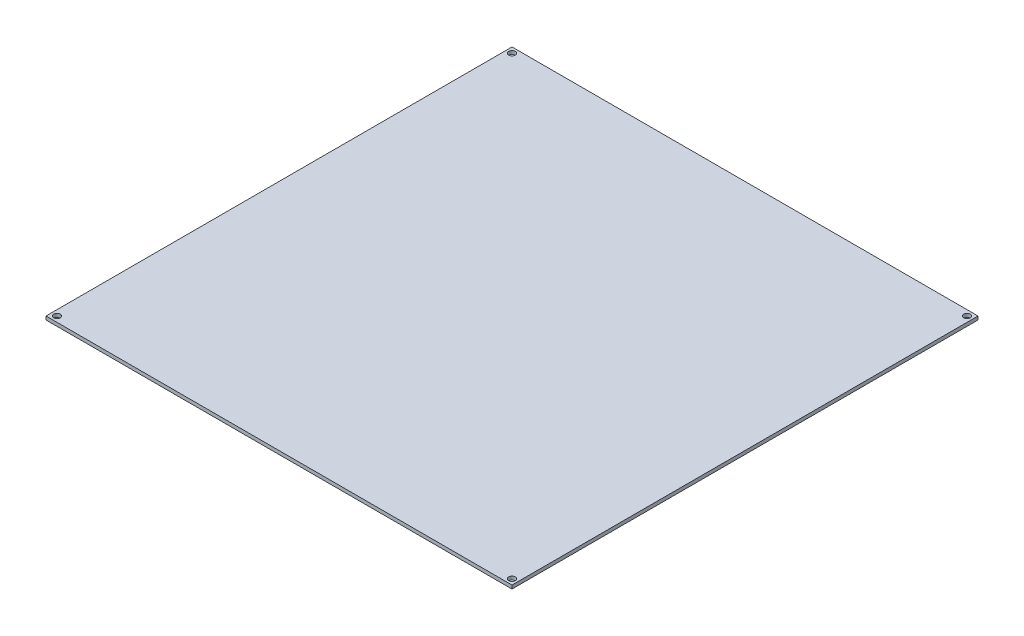
ISO-10303-21;
HEADER;
FILE_DESCRIPTION(('STEP AP214'),'2;1');
FILE_NAME('part.step','',(''),(''),'','','');
FILE_SCHEMA(('AUTOMOTIVE_DESIGN { 1 0 10303 214 1 1 1 1 }'));
ENDSEC;
DATA;
#1=APPLICATION_CONTEXT('core data for automotive mechanical design processes');
#2=APPLICATION_PROTOCOL_DEFINITION('international standard','automotive_design',2000,#1);
#3=PRODUCT_CONTEXT('',#1,'mechanical');
#4=PRODUCT('Part','Part','',(#3));
#5=PRODUCT_RELATED_PRODUCT_CATEGORY('part','',(#4));
#6=PRODUCT_DEFINITION_FORMATION('','',#4);
#7=PRODUCT_DEFINITION_CONTEXT('part definition',#1,'design');
#8=PRODUCT_DEFINITION('design','',#6,#7);
#9=PRODUCT_DEFINITION_SHAPE('','',#8);
#10=(LENGTH_UNIT() NAMED_UNIT(*) SI_UNIT(.MILLI.,.METRE.));
#11=(NAMED_UNIT(*) PLANE_ANGLE_UNIT() SI_UNIT($,.RADIAN.));
#12=(NAMED_UNIT(*) SI_UNIT($,.STERADIAN.) SOLID_ANGLE_UNIT());
#13=UNCERTAINTY_MEASURE_WITH_UNIT(LENGTH_MEASURE(1.E-05),#10,'distance_accuracy_value','');
#14=(GEOMETRIC_REPRESENTATION_CONTEXT(3) GLOBAL_UNCERTAINTY_ASSIGNED_CONTEXT((#13)) GLOBAL_UNIT_ASSIGNED_CONTEXT((#10,
#11,#12)) REPRESENTATION_CONTEXT('',''));
#15=CARTESIAN_POINT('',(0.,0.,0.));
#16=DIRECTION('',(0.,0.,1.));
#17=DIRECTION('',(1.,0.,0.));
#18=AXIS2_PLACEMENT_3D('',#15,#16,#17);
#19=CARTESIAN_POINT('',(0.,1.6,0.));
#20=DIRECTION('',(0.,-1.,0.));
#21=DIRECTION('',(0.,0.,-1.));
#22=AXIS2_PLACEMENT_3D('',#19,#20,#21);
#23=PLANE('',#22);
#24=DIRECTION('',(0.,0.,-1.));
#25=VECTOR('',#24,1.);
#26=CARTESIAN_POINT('',(107.,1.6,107.));
#27=LINE('',#26,#25);
#28=CARTESIAN_POINT('',(107.,1.6,107.));
#29=VERTEX_POINT('',#28);
#30=CARTESIAN_POINT('',(107.,1.6,-107.));
#31=VERTEX_POINT('',#30);
#32=EDGE_CURVE('E84',#29,#31,#27,.T.);
#33=ORIENTED_EDGE('',*,*,#32,.T.);
#34=DIRECTION('',(-1.,0.,0.));
#35=VECTOR('',#34,1.);
#36=CARTESIAN_POINT('',(-107.,1.6,-107.));
#37=LINE('',#36,#35);
#38=CARTESIAN_POINT('',(-107.,1.6,-107.));
#39=VERTEX_POINT('',#38);
#40=EDGE_CURVE('E79',#31,#39,#37,.T.);
#41=ORIENTED_EDGE('',*,*,#40,.T.);
#42=DIRECTION('',(0.,0.,1.));
#43=VECTOR('',#42,1.);
#44=CARTESIAN_POINT('',(-107.,1.6,107.));
#45=LINE('',#44,#43);
#46=CARTESIAN_POINT('',(-107.,1.6,107.));
#47=VERTEX_POINT('',#46);
#48=EDGE_CURVE('E82',#39,#47,#45,.T.);
#49=ORIENTED_EDGE('',*,*,#48,.T.);
#50=DIRECTION('',(1.,0.,0.));
#51=VECTOR('',#50,1.);
#52=CARTESIAN_POINT('',(-107.,1.6,107.));
#53=LINE('',#52,#51);
#54=EDGE_CURVE('E49',#47,#29,#53,.T.);
#55=ORIENTED_EDGE('',*,*,#54,.T.);
#56=EDGE_LOOP('',(#33,#41,#49,#55));
#57=FACE_BOUND('',#56,.T.);
#58=CARTESIAN_POINT('',(-104.5,1.6,-104.5));
#59=DIRECTION('',(0.,1.,0.));
#60=DIRECTION('',(0.,0.,1.));
#61=AXIS2_PLACEMENT_3D('',#58,#59,#60);
#62=CIRCLE('',#61,1.5);
#63=CARTESIAN_POINT('',(-104.5,1.6,-103.));
#64=VERTEX_POINT('',#63);
#65=EDGE_CURVE('E99',#64,#64,#62,.T.);
#66=ORIENTED_EDGE('',*,*,#65,.F.);
#67=EDGE_LOOP('',(#66));
#68=FACE_BOUND('',#67,.T.);
#69=CARTESIAN_POINT('',(104.5,1.6,-104.5));
#70=DIRECTION('',(0.,1.,0.));
#71=DIRECTION('',(0.,0.,1.));
#72=AXIS2_PLACEMENT_3D('',#69,#70,#71);
#73=CIRCLE('',#72,1.5);
#74=CARTESIAN_POINT('',(104.5,1.6,-103.));
#75=VERTEX_POINT('',#74);
#76=EDGE_CURVE('E114',#75,#75,#73,.T.);
#77=ORIENTED_EDGE('',*,*,#76,.F.);
#78=EDGE_LOOP('',(#77));
#79=FACE_BOUND('',#78,.T.);
#80=CARTESIAN_POINT('',(104.5,1.6,104.5));
#81=DIRECTION('',(0.,1.,0.));
#82=DIRECTION('',(0.,0.,1.));
#83=AXIS2_PLACEMENT_3D('',#80,#81,#82);
#84=CIRCLE('',#83,1.5);
#85=CARTESIAN_POINT('',(104.5,1.6,106.));
#86=VERTEX_POINT('',#85);
#87=EDGE_CURVE('E120',#86,#86,#84,.T.);
#88=ORIENTED_EDGE('',*,*,#87,.F.);
#89=EDGE_LOOP('',(#88));
#90=FACE_BOUND('',#89,.T.);
#91=CARTESIAN_POINT('',(-104.5,1.6,104.5));
#92=DIRECTION('',(0.,1.,0.));
#93=DIRECTION('',(0.,0.,1.));
#94=AXIS2_PLACEMENT_3D('',#91,#92,#93);
#95=CIRCLE('',#94,1.5);
#96=CARTESIAN_POINT('',(-104.5,1.6,106.));
#97=VERTEX_POINT('',#96);
#98=EDGE_CURVE('E126',#97,#97,#95,.T.);
#99=ORIENTED_EDGE('',*,*,#98,.F.);
#100=EDGE_LOOP('',(#99));
#101=FACE_BOUND('',#100,.T.);
#102=ADVANCED_FACE('F32',(#57,#68,#79,#90,#101),#23,.F.);
#103=CARTESIAN_POINT('',(0.,0.,0.));
#104=DIRECTION('',(0.,-1.,0.));
#105=DIRECTION('',(0.,0.,-1.));
#106=AXIS2_PLACEMENT_3D('',#103,#104,#105);
#107=PLANE('',#106);
#108=CARTESIAN_POINT('',(104.5,0.,104.5));
#109=DIRECTION('',(0.,1.,0.));
#110=DIRECTION('',(0.,0.,1.));
#111=AXIS2_PLACEMENT_3D('',#108,#109,#110);
#112=CIRCLE('',#111,1.5);
#113=CARTESIAN_POINT('',(104.5,0.,106.));
#114=VERTEX_POINT('',#113);
#115=EDGE_CURVE('E123',#114,#114,#112,.T.);
#116=ORIENTED_EDGE('',*,*,#115,.T.);
#117=EDGE_LOOP('',(#116));
#118=FACE_BOUND('',#117,.T.);
#119=CARTESIAN_POINT('',(-104.5,0.,-104.5));
#120=DIRECTION('',(0.,1.,0.));
#121=DIRECTION('',(0.,0.,1.));
#122=AXIS2_PLACEMENT_3D('',#119,#120,#121);
#123=CIRCLE('',#122,1.5);
#124=CARTESIAN_POINT('',(-104.5,0.,-103.));
#125=VERTEX_POINT('',#124);
#126=EDGE_CURVE('E111',#125,#125,#123,.T.);
#127=ORIENTED_EDGE('',*,*,#126,.T.);
#128=EDGE_LOOP('',(#127));
#129=FACE_BOUND('',#128,.T.);
#130=DIRECTION('',(0.,0.,-1.));
#131=VECTOR('',#130,1.);
#132=CARTESIAN_POINT('',(107.,0.,107.));
#133=LINE('',#132,#131);
#134=CARTESIAN_POINT('',(107.,0.,107.));
#135=VERTEX_POINT('',#134);
#136=CARTESIAN_POINT('',(107.,0.,-107.));
#137=VERTEX_POINT('',#136);
#138=EDGE_CURVE('E96',#135,#137,#133,.T.);
#139=ORIENTED_EDGE('',*,*,#138,.F.);
#140=DIRECTION('',(1.,0.,0.));
#141=VECTOR('',#140,1.);
#142=CARTESIAN_POINT('',(-107.,0.,107.));
#143=LINE('',#142,#141);
#144=CARTESIAN_POINT('',(-107.,0.,107.));
#145=VERTEX_POINT('',#144);
#146=EDGE_CURVE('E72',#145,#135,#143,.T.);
#147=ORIENTED_EDGE('',*,*,#146,.F.);
#148=DIRECTION('',(0.,0.,1.));
#149=VECTOR('',#148,1.);
#150=CARTESIAN_POINT('',(-107.,0.,107.));
#151=LINE('',#150,#149);
#152=CARTESIAN_POINT('',(-107.,0.,-107.));
#153=VERTEX_POINT('',#152);
#154=EDGE_CURVE('E66',#153,#145,#151,.T.);
#155=ORIENTED_EDGE('',*,*,#154,.F.);
#156=DIRECTION('',(-1.,0.,0.));
#157=VECTOR('',#156,1.);
#158=CARTESIAN_POINT('',(-107.,0.,-107.));
#159=LINE('',#158,#157);
#160=EDGE_CURVE('E88',#137,#153,#159,.T.);
#161=ORIENTED_EDGE('',*,*,#160,.F.);
#162=EDGE_LOOP('',(#139,#147,#155,#161));
#163=FACE_BOUND('',#162,.T.);
#164=CARTESIAN_POINT('',(104.5,0.,-104.5));
#165=DIRECTION('',(0.,1.,0.));
#166=DIRECTION('',(0.,0.,1.));
#167=AXIS2_PLACEMENT_3D('',#164,#165,#166);
#168=CIRCLE('',#167,1.5);
#169=CARTESIAN_POINT('',(104.5,0.,-103.));
#170=VERTEX_POINT('',#169);
#171=EDGE_CURVE('E117',#170,#170,#168,.T.);
#172=ORIENTED_EDGE('',*,*,#171,.T.);
#173=EDGE_LOOP('',(#172));
#174=FACE_BOUND('',#173,.T.);
#175=CARTESIAN_POINT('',(-104.5,0.,104.5));
#176=DIRECTION('',(0.,1.,0.));
#177=DIRECTION('',(0.,0.,1.));
#178=AXIS2_PLACEMENT_3D('',#175,#176,#177);
#179=CIRCLE('',#178,1.5);
#180=CARTESIAN_POINT('',(-104.5,0.,106.));
#181=VERTEX_POINT('',#180);
#182=EDGE_CURVE('E129',#181,#181,#179,.T.);
#183=ORIENTED_EDGE('',*,*,#182,.T.);
#184=EDGE_LOOP('',(#183));
#185=FACE_BOUND('',#184,.T.);
#186=ADVANCED_FACE('F107',(#118,#129,#163,#174,#185),#107,.T.);
#187=CARTESIAN_POINT('',(107.,1.6,107.));
#188=DIRECTION('',(-1.,0.,0.));
#189=DIRECTION('',(0.,0.,1.));
#190=AXIS2_PLACEMENT_3D('',#187,#188,#189);
#191=PLANE('',#190);
#192=ORIENTED_EDGE('',*,*,#138,.T.);
#193=DIRECTION('',(0.,-1.,0.));
#194=VECTOR('',#193,1.);
#195=CARTESIAN_POINT('',(107.,1.6,-107.));
#196=LINE('',#195,#194);
#197=EDGE_CURVE('E11',#31,#137,#196,.T.);
#198=ORIENTED_EDGE('',*,*,#197,.F.);
#199=ORIENTED_EDGE('',*,*,#32,.F.);
#200=DIRECTION('',(0.,-1.,0.));
#201=VECTOR('',#200,1.);
#202=CARTESIAN_POINT('',(107.,1.6,107.));
#203=LINE('',#202,#201);
#204=EDGE_CURVE('E92',#29,#135,#203,.T.);
#205=ORIENTED_EDGE('',*,*,#204,.T.);
#206=EDGE_LOOP('',(#192,#198,#199,#205));
#207=FACE_BOUND('',#206,.T.);
#208=ADVANCED_FACE('F34',(#207),#191,.F.);
#209=CARTESIAN_POINT('',(-107.,1.6,-107.));
#210=DIRECTION('',(0.,0.,1.));
#211=DIRECTION('',(1.,0.,0.));
#212=AXIS2_PLACEMENT_3D('',#209,#210,#211);
#213=PLANE('',#212);
#214=ORIENTED_EDGE('',*,*,#160,.T.);
#215=DIRECTION('',(0.,-1.,0.));
#216=VECTOR('',#215,1.);
#217=CARTESIAN_POINT('',(-107.,1.6,-107.));
#218=LINE('',#217,#216);
#219=EDGE_CURVE('E41',#39,#153,#218,.T.);
#220=ORIENTED_EDGE('',*,*,#219,.F.);
#221=ORIENTED_EDGE('',*,*,#40,.F.);
#222=ORIENTED_EDGE('',*,*,#197,.T.);
#223=EDGE_LOOP('',(#214,#220,#221,#222));
#224=FACE_BOUND('',#223,.T.);
#225=ADVANCED_FACE('F87',(#224),#213,.F.);
#226=CARTESIAN_POINT('',(-107.,1.6,107.));
#227=DIRECTION('',(1.,0.,0.));
#228=DIRECTION('',(0.,0.,-1.));
#229=AXIS2_PLACEMENT_3D('',#226,#227,#228);
#230=PLANE('',#229);
#231=ORIENTED_EDGE('',*,*,#154,.T.);
#232=DIRECTION('',(0.,-1.,0.));
#233=VECTOR('',#232,1.);
#234=CARTESIAN_POINT('',(-107.,1.6,107.));
#235=LINE('',#234,#233);
#236=EDGE_CURVE('E89',#47,#145,#235,.T.);
#237=ORIENTED_EDGE('',*,*,#236,.F.);
#238=ORIENTED_EDGE('',*,*,#48,.F.);
#239=ORIENTED_EDGE('',*,*,#219,.T.);
#240=EDGE_LOOP('',(#231,#237,#238,#239));
#241=FACE_BOUND('',#240,.T.);
#242=ADVANCED_FACE('F90',(#241),#230,.F.);
#243=CARTESIAN_POINT('',(-107.,1.6,107.));
#244=DIRECTION('',(0.,0.,-1.));
#245=DIRECTION('',(-1.,0.,0.));
#246=AXIS2_PLACEMENT_3D('',#243,#244,#245);
#247=PLANE('',#246);
#248=ORIENTED_EDGE('',*,*,#146,.T.);
#249=ORIENTED_EDGE('',*,*,#204,.F.);
#250=ORIENTED_EDGE('',*,*,#54,.F.);
#251=ORIENTED_EDGE('',*,*,#236,.T.);
#252=EDGE_LOOP('',(#248,#249,#250,#251));
#253=FACE_BOUND('',#252,.T.);
#254=ADVANCED_FACE('F104',(#253),#247,.F.);
#255=CARTESIAN_POINT('',(-104.5,1.6,-104.5));
#256=DIRECTION('',(0.,-1.,0.));
#257=DIRECTION('',(0.,0.,-1.));
#258=AXIS2_PLACEMENT_3D('',#255,#256,#257);
#259=CYLINDRICAL_SURFACE('',#258,1.5);
#260=ORIENTED_EDGE('',*,*,#65,.T.);
#261=EDGE_LOOP('',(#260));
#262=FACE_BOUND('',#261,.T.);
#263=ORIENTED_EDGE('',*,*,#126,.F.);
#264=EDGE_LOOP('',(#263));
#265=FACE_BOUND('',#264,.T.);
#266=ADVANCED_FACE('F146',(#262,#265),#259,.F.);
#267=CARTESIAN_POINT('',(104.5,1.6,-104.5));
#268=DIRECTION('',(0.,-1.,0.));
#269=DIRECTION('',(0.,0.,-1.));
#270=AXIS2_PLACEMENT_3D('',#267,#268,#269);
#271=CYLINDRICAL_SURFACE('',#270,1.5);
#272=ORIENTED_EDGE('',*,*,#76,.T.);
#273=EDGE_LOOP('',(#272));
#274=FACE_BOUND('',#273,.T.);
#275=ORIENTED_EDGE('',*,*,#171,.F.);
#276=EDGE_LOOP('',(#275));
#277=FACE_BOUND('',#276,.T.);
#278=ADVANCED_FACE('F192',(#274,#277),#271,.F.);
#279=CARTESIAN_POINT('',(104.5,1.6,104.5));
#280=DIRECTION('',(0.,-1.,0.));
#281=DIRECTION('',(0.,0.,-1.));
#282=AXIS2_PLACEMENT_3D('',#279,#280,#281);
#283=CYLINDRICAL_SURFACE('',#282,1.5);
#284=ORIENTED_EDGE('',*,*,#87,.T.);
#285=EDGE_LOOP('',(#284));
#286=FACE_BOUND('',#285,.T.);
#287=ORIENTED_EDGE('',*,*,#115,.F.);
#288=EDGE_LOOP('',(#287));
#289=FACE_BOUND('',#288,.T.);
#290=ADVANCED_FACE('F200',(#286,#289),#283,.F.);
#291=CARTESIAN_POINT('',(-104.5,1.6,104.5));
#292=DIRECTION('',(0.,-1.,0.));
#293=DIRECTION('',(0.,0.,-1.));
#294=AXIS2_PLACEMENT_3D('',#291,#292,#293);
#295=CYLINDRICAL_SURFACE('',#294,1.5);
#296=ORIENTED_EDGE('',*,*,#98,.T.);
#297=EDGE_LOOP('',(#296));
#298=FACE_BOUND('',#297,.T.);
#299=ORIENTED_EDGE('',*,*,#182,.F.);
#300=EDGE_LOOP('',(#299));
#301=FACE_BOUND('',#300,.T.);
#302=ADVANCED_FACE('F135',(#298,#301),#295,.F.);
#303=CLOSED_SHELL('',(#102,#186,#208,#225,#242,#254,#266,#278,#290,#302));
#304=MANIFOLD_SOLID_BREP('B2',#303);
#305=ADVANCED_BREP_SHAPE_REPRESENTATION('',(#18,#304),#14);
#306=SHAPE_DEFINITION_REPRESENTATION(#9,#305);
ENDSEC;
END-ISO-10303-21;
